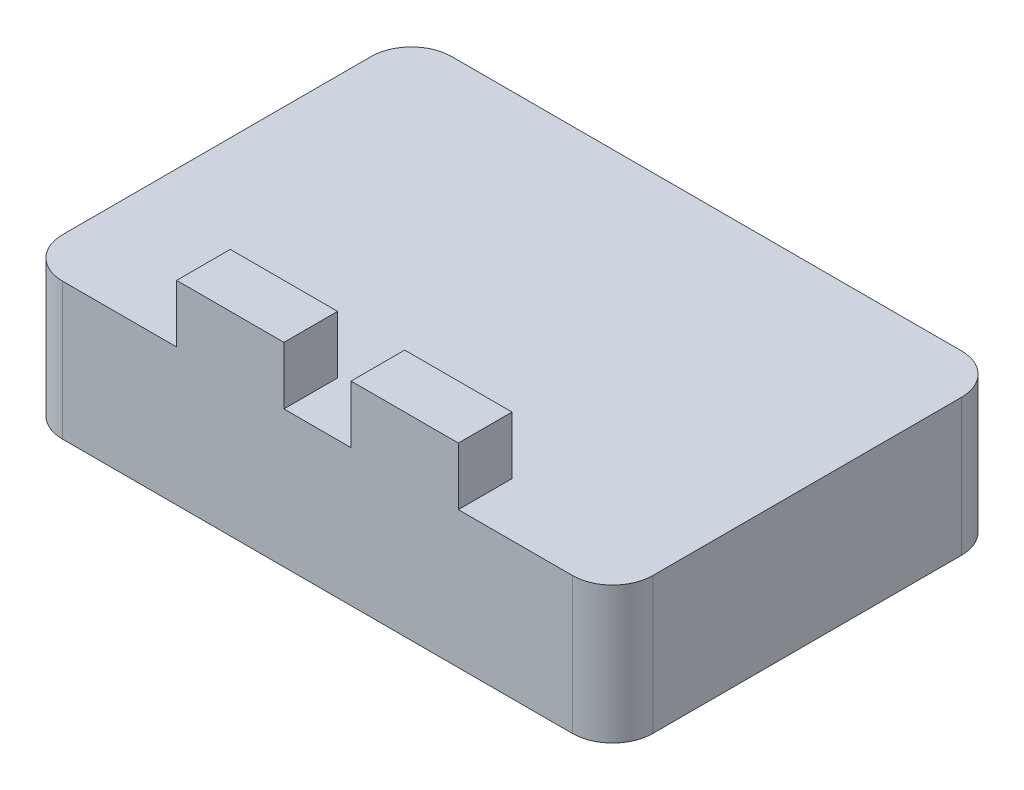
ISO-10303-21;
HEADER;
FILE_DESCRIPTION(('STEP AP214'),'2;1');
FILE_NAME('part.step','',(''),(''),'','','');
FILE_SCHEMA(('AUTOMOTIVE_DESIGN { 1 0 10303 214 1 1 1 1 }'));
ENDSEC;
DATA;
#1=APPLICATION_CONTEXT('core data for automotive mechanical design processes');
#2=APPLICATION_PROTOCOL_DEFINITION('international standard','automotive_design',2000,#1);
#3=PRODUCT_CONTEXT('',#1,'mechanical');
#4=PRODUCT('Part','Part','',(#3));
#5=PRODUCT_RELATED_PRODUCT_CATEGORY('part','',(#4));
#6=PRODUCT_DEFINITION_FORMATION('','',#4);
#7=PRODUCT_DEFINITION_CONTEXT('part definition',#1,'design');
#8=PRODUCT_DEFINITION('design','',#6,#7);
#9=PRODUCT_DEFINITION_SHAPE('','',#8);
#10=(LENGTH_UNIT() NAMED_UNIT(*) SI_UNIT(.MILLI.,.METRE.));
#11=(NAMED_UNIT(*) PLANE_ANGLE_UNIT() SI_UNIT($,.RADIAN.));
#12=(NAMED_UNIT(*) SI_UNIT($,.STERADIAN.) SOLID_ANGLE_UNIT());
#13=UNCERTAINTY_MEASURE_WITH_UNIT(LENGTH_MEASURE(1.E-05),#10,'distance_accuracy_value','');
#14=(GEOMETRIC_REPRESENTATION_CONTEXT(3) GLOBAL_UNCERTAINTY_ASSIGNED_CONTEXT((#13)) GLOBAL_UNIT_ASSIGNED_CONTEXT((#10,
#11,#12)) REPRESENTATION_CONTEXT('',''));
#15=CARTESIAN_POINT('',(0.,0.,0.));
#16=DIRECTION('',(0.,0.,1.));
#17=DIRECTION('',(1.,0.,0.));
#18=AXIS2_PLACEMENT_3D('',#15,#16,#17);
#19=CARTESIAN_POINT('',(0.,10.2,0.));
#20=DIRECTION('',(0.,-1.,0.));
#21=DIRECTION('',(0.,0.,-1.));
#22=AXIS2_PLACEMENT_3D('',#19,#20,#21);
#23=PLANE('',#22);
#24=DIRECTION('',(0.,0.,-1.));
#25=VECTOR('',#24,1.);
#26=CARTESIAN_POINT('',(44.,10.2,0.));
#27=LINE('',#26,#25);
#28=CARTESIAN_POINT('',(44.,10.2,-3.));
#29=VERTEX_POINT('',#28);
#30=CARTESIAN_POINT('',(44.,10.2,-26.));
#31=VERTEX_POINT('',#30);
#32=EDGE_CURVE('E262',#29,#31,#27,.T.);
#33=ORIENTED_EDGE('',*,*,#32,.T.);
#34=CARTESIAN_POINT('',(41.,10.2,-26.));
#35=DIRECTION('',(0.,-1.,0.));
#36=DIRECTION('',(0.,0.,-1.));
#37=AXIS2_PLACEMENT_3D('',#34,#35,#36);
#38=CIRCLE('',#37,3.);
#39=CARTESIAN_POINT('',(41.,10.2,-29.));
#40=VERTEX_POINT('',#39);
#41=EDGE_CURVE('E315',#31,#40,#38,.F.);
#42=ORIENTED_EDGE('',*,*,#41,.T.);
#43=DIRECTION('',(-1.,0.,0.));
#44=VECTOR('',#43,1.);
#45=CARTESIAN_POINT('',(0.,10.2,-29.));
#46=LINE('',#45,#44);
#47=CARTESIAN_POINT('',(3.,10.2,-29.));
#48=VERTEX_POINT('',#47);
#49=EDGE_CURVE('E265',#40,#48,#46,.T.);
#50=ORIENTED_EDGE('',*,*,#49,.T.);
#51=CARTESIAN_POINT('',(3.,10.2,-26.));
#52=DIRECTION('',(0.,-1.,0.));
#53=DIRECTION('',(0.,0.,-1.));
#54=AXIS2_PLACEMENT_3D('',#51,#52,#53);
#55=CIRCLE('',#54,3.);
#56=CARTESIAN_POINT('',(0.,10.2,-26.));
#57=VERTEX_POINT('',#56);
#58=EDGE_CURVE('E312',#48,#57,#55,.F.);
#59=ORIENTED_EDGE('',*,*,#58,.T.);
#60=DIRECTION('',(0.,0.,1.));
#61=VECTOR('',#60,1.);
#62=CARTESIAN_POINT('',(0.,10.2,0.));
#63=LINE('',#62,#61);
#64=CARTESIAN_POINT('',(0.,10.2,-3.));
#65=VERTEX_POINT('',#64);
#66=EDGE_CURVE('E169',#57,#65,#63,.T.);
#67=ORIENTED_EDGE('',*,*,#66,.T.);
#68=CARTESIAN_POINT('',(3.,10.2,-3.));
#69=DIRECTION('',(0.,-1.,0.));
#70=DIRECTION('',(0.,0.,-1.));
#71=AXIS2_PLACEMENT_3D('',#68,#69,#70);
#72=CIRCLE('',#71,3.);
#73=CARTESIAN_POINT('',(3.,10.2,0.));
#74=VERTEX_POINT('',#73);
#75=EDGE_CURVE('E58',#65,#74,#72,.F.);
#76=ORIENTED_EDGE('',*,*,#75,.T.);
#77=DIRECTION('',(1.,0.,0.));
#78=VECTOR('',#77,1.);
#79=CARTESIAN_POINT('',(0.,10.2,0.));
#80=LINE('',#79,#78);
#81=CARTESIAN_POINT('',(11.5,10.2,0.));
#82=VERTEX_POINT('',#81);
#83=EDGE_CURVE('E171',#74,#82,#80,.T.);
#84=ORIENTED_EDGE('',*,*,#83,.T.);
#85=DIRECTION('',(0.,0.,1.));
#86=VECTOR('',#85,1.);
#87=CARTESIAN_POINT('',(11.5,10.2,0.));
#88=LINE('',#87,#86);
#89=CARTESIAN_POINT('',(11.5,10.2,-4.));
#90=VERTEX_POINT('',#89);
#91=EDGE_CURVE('E206',#90,#82,#88,.T.);
#92=ORIENTED_EDGE('',*,*,#91,.F.);
#93=DIRECTION('',(-1.,0.,0.));
#94=VECTOR('',#93,1.);
#95=CARTESIAN_POINT('',(19.5,10.2,-4.));
#96=LINE('',#95,#94);
#97=CARTESIAN_POINT('',(19.5,10.2,-4.));
#98=VERTEX_POINT('',#97);
#99=EDGE_CURVE('E222',#98,#90,#96,.T.);
#100=ORIENTED_EDGE('',*,*,#99,.F.);
#101=DIRECTION('',(0.,0.,-1.));
#102=VECTOR('',#101,1.);
#103=CARTESIAN_POINT('',(19.5,10.2,0.));
#104=LINE('',#103,#102);
#105=CARTESIAN_POINT('',(19.5,10.2,0.));
#106=VERTEX_POINT('',#105);
#107=EDGE_CURVE('E235',#106,#98,#104,.T.);
#108=ORIENTED_EDGE('',*,*,#107,.F.);
#109=CARTESIAN_POINT('',(24.5,10.2,0.));
#110=VERTEX_POINT('',#109);
#111=EDGE_CURVE('E168',#106,#110,#80,.T.);
#112=ORIENTED_EDGE('',*,*,#111,.T.);
#113=DIRECTION('',(0.,0.,1.));
#114=VECTOR('',#113,1.);
#115=CARTESIAN_POINT('',(24.5,10.2,0.));
#116=LINE('',#115,#114);
#117=CARTESIAN_POINT('',(24.5,10.2,-4.));
#118=VERTEX_POINT('',#117);
#119=EDGE_CURVE('E181',#118,#110,#116,.T.);
#120=ORIENTED_EDGE('',*,*,#119,.F.);
#121=DIRECTION('',(-1.,0.,0.));
#122=VECTOR('',#121,1.);
#123=CARTESIAN_POINT('',(24.5,10.2,-4.));
#124=LINE('',#123,#122);
#125=CARTESIAN_POINT('',(32.5,10.2,-4.));
#126=VERTEX_POINT('',#125);
#127=EDGE_CURVE('E176',#126,#118,#124,.T.);
#128=ORIENTED_EDGE('',*,*,#127,.F.);
#129=DIRECTION('',(0.,0.,-1.));
#130=VECTOR('',#129,1.);
#131=CARTESIAN_POINT('',(32.5,10.2,0.));
#132=LINE('',#131,#130);
#133=CARTESIAN_POINT('',(32.5,10.2,0.));
#134=VERTEX_POINT('',#133);
#135=EDGE_CURVE('E173',#134,#126,#132,.T.);
#136=ORIENTED_EDGE('',*,*,#135,.F.);
#137=CARTESIAN_POINT('',(41.,10.2,0.));
#138=VERTEX_POINT('',#137);
#139=EDGE_CURVE('E158',#134,#138,#80,.T.);
#140=ORIENTED_EDGE('',*,*,#139,.T.);
#141=CARTESIAN_POINT('',(41.,10.2,-3.));
#142=DIRECTION('',(0.,-1.,0.));
#143=DIRECTION('',(0.,0.,-1.));
#144=AXIS2_PLACEMENT_3D('',#141,#142,#143);
#145=CIRCLE('',#144,3.);
#146=EDGE_CURVE('E307',#138,#29,#145,.F.);
#147=ORIENTED_EDGE('',*,*,#146,.T.);
#148=EDGE_LOOP('',(#33,#42,#50,#59,#67,#76,#84,#92,#100,#108,#112,#120,#128,#136,#140,#147));
#149=FACE_BOUND('',#148,.T.);
#150=ADVANCED_FACE('F42',(#149),#23,.F.);
#151=CARTESIAN_POINT('',(0.,10.2,0.));
#152=DIRECTION('',(1.,0.,0.));
#153=DIRECTION('',(0.,0.,-1.));
#154=AXIS2_PLACEMENT_3D('',#151,#152,#153);
#155=PLANE('',#154);
#156=ORIENTED_EDGE('',*,*,#66,.F.);
#157=DIRECTION('',(0.,-1.,0.));
#158=VECTOR('',#157,1.);
#159=CARTESIAN_POINT('',(0.,10.2,-26.));
#160=LINE('',#159,#158);
#161=CARTESIAN_POINT('',(0.,0.,-26.));
#162=VERTEX_POINT('',#161);
#163=EDGE_CURVE('E320',#57,#162,#160,.T.);
#164=ORIENTED_EDGE('',*,*,#163,.T.);
#165=DIRECTION('',(0.,0.,1.));
#166=VECTOR('',#165,1.);
#167=CARTESIAN_POINT('',(0.,0.,0.));
#168=LINE('',#167,#166);
#169=CARTESIAN_POINT('',(0.,0.,-3.));
#170=VERTEX_POINT('',#169);
#171=EDGE_CURVE('E257',#162,#170,#168,.T.);
#172=ORIENTED_EDGE('',*,*,#171,.T.);
#173=DIRECTION('',(0.,-1.,0.));
#174=VECTOR('',#173,1.);
#175=CARTESIAN_POINT('',(0.,10.2,-3.));
#176=LINE('',#175,#174);
#177=EDGE_CURVE('E66',#170,#65,#176,.F.);
#178=ORIENTED_EDGE('',*,*,#177,.T.);
#179=EDGE_LOOP('',(#156,#164,#172,#178));
#180=FACE_BOUND('',#179,.T.);
#181=ADVANCED_FACE('F350',(#180),#155,.F.);
#182=CARTESIAN_POINT('',(0.,10.2,0.));
#183=DIRECTION('',(0.,0.,-1.));
#184=DIRECTION('',(-1.,0.,0.));
#185=AXIS2_PLACEMENT_3D('',#182,#183,#184);
#186=PLANE('',#185);
#187=ORIENTED_EDGE('',*,*,#83,.F.);
#188=DIRECTION('',(0.,-1.,0.));
#189=VECTOR('',#188,1.);
#190=CARTESIAN_POINT('',(3.,10.2,0.));
#191=LINE('',#190,#189);
#192=CARTESIAN_POINT('',(3.,0.,0.));
#193=VERTEX_POINT('',#192);
#194=EDGE_CURVE('E11',#74,#193,#191,.T.);
#195=ORIENTED_EDGE('',*,*,#194,.T.);
#196=DIRECTION('',(1.,0.,0.));
#197=VECTOR('',#196,1.);
#198=CARTESIAN_POINT('',(0.,0.,0.));
#199=LINE('',#198,#197);
#200=CARTESIAN_POINT('',(41.,0.,0.));
#201=VERTEX_POINT('',#200);
#202=EDGE_CURVE('E272',#193,#201,#199,.T.);
#203=ORIENTED_EDGE('',*,*,#202,.T.);
#204=DIRECTION('',(0.,-1.,0.));
#205=VECTOR('',#204,1.);
#206=CARTESIAN_POINT('',(41.,10.2,0.));
#207=LINE('',#206,#205);
#208=EDGE_CURVE('E51',#201,#138,#207,.F.);
#209=ORIENTED_EDGE('',*,*,#208,.T.);
#210=ORIENTED_EDGE('',*,*,#139,.F.);
#211=DIRECTION('',(0.,-1.,0.));
#212=VECTOR('',#211,1.);
#213=CARTESIAN_POINT('',(32.5,14.5,0.));
#214=LINE('',#213,#212);
#215=CARTESIAN_POINT('',(32.5,14.5,0.));
#216=VERTEX_POINT('',#215);
#217=EDGE_CURVE('E162',#216,#134,#214,.T.);
#218=ORIENTED_EDGE('',*,*,#217,.F.);
#219=DIRECTION('',(1.,0.,0.));
#220=VECTOR('',#219,1.);
#221=CARTESIAN_POINT('',(24.5,14.5,0.));
#222=LINE('',#221,#220);
#223=CARTESIAN_POINT('',(24.5,14.5,0.));
#224=VERTEX_POINT('',#223);
#225=EDGE_CURVE('E211',#224,#216,#222,.T.);
#226=ORIENTED_EDGE('',*,*,#225,.F.);
#227=DIRECTION('',(0.,-1.,0.));
#228=VECTOR('',#227,1.);
#229=CARTESIAN_POINT('',(24.5,14.5,0.));
#230=LINE('',#229,#228);
#231=EDGE_CURVE('E187',#224,#110,#230,.T.);
#232=ORIENTED_EDGE('',*,*,#231,.T.);
#233=ORIENTED_EDGE('',*,*,#111,.F.);
#234=DIRECTION('',(0.,-1.,0.));
#235=VECTOR('',#234,1.);
#236=CARTESIAN_POINT('',(19.5,14.5,0.));
#237=LINE('',#236,#235);
#238=CARTESIAN_POINT('',(19.5,14.5,0.));
#239=VERTEX_POINT('',#238);
#240=EDGE_CURVE('E249',#239,#106,#237,.T.);
#241=ORIENTED_EDGE('',*,*,#240,.F.);
#242=DIRECTION('',(1.,0.,0.));
#243=VECTOR('',#242,1.);
#244=CARTESIAN_POINT('',(19.5,14.5,0.));
#245=LINE('',#244,#243);
#246=CARTESIAN_POINT('',(11.5,14.5,0.));
#247=VERTEX_POINT('',#246);
#248=EDGE_CURVE('E221',#247,#239,#245,.T.);
#249=ORIENTED_EDGE('',*,*,#248,.F.);
#250=DIRECTION('',(0.,-1.,0.));
#251=VECTOR('',#250,1.);
#252=CARTESIAN_POINT('',(11.5,14.5,0.));
#253=LINE('',#252,#251);
#254=EDGE_CURVE('E253',#247,#82,#253,.T.);
#255=ORIENTED_EDGE('',*,*,#254,.T.);
#256=EDGE_LOOP('',(#187,#195,#203,#209,#210,#218,#226,#232,#233,#241,#249,#255));
#257=FACE_BOUND('',#256,.T.);
#258=ADVANCED_FACE('F160',(#257),#186,.F.);
#259=CARTESIAN_POINT('',(44.,10.2,0.));
#260=DIRECTION('',(-1.,0.,0.));
#261=DIRECTION('',(0.,0.,1.));
#262=AXIS2_PLACEMENT_3D('',#259,#260,#261);
#263=PLANE('',#262);
#264=DIRECTION('',(0.,0.,-1.));
#265=VECTOR('',#264,1.);
#266=CARTESIAN_POINT('',(44.,0.,0.));
#267=LINE('',#266,#265);
#268=CARTESIAN_POINT('',(44.,0.,-3.));
#269=VERTEX_POINT('',#268);
#270=CARTESIAN_POINT('',(44.,0.,-26.));
#271=VERTEX_POINT('',#270);
#272=EDGE_CURVE('E275',#269,#271,#267,.T.);
#273=ORIENTED_EDGE('',*,*,#272,.T.);
#274=DIRECTION('',(0.,-1.,0.));
#275=VECTOR('',#274,1.);
#276=CARTESIAN_POINT('',(44.,10.2,-26.));
#277=LINE('',#276,#275);
#278=EDGE_CURVE('E304',#271,#31,#277,.F.);
#279=ORIENTED_EDGE('',*,*,#278,.T.);
#280=ORIENTED_EDGE('',*,*,#32,.F.);
#281=DIRECTION('',(0.,-1.,0.));
#282=VECTOR('',#281,1.);
#283=CARTESIAN_POINT('',(44.,10.2,-3.));
#284=LINE('',#283,#282);
#285=EDGE_CURVE('E300',#29,#269,#284,.T.);
#286=ORIENTED_EDGE('',*,*,#285,.T.);
#287=EDGE_LOOP('',(#273,#279,#280,#286));
#288=FACE_BOUND('',#287,.T.);
#289=ADVANCED_FACE('F367',(#288),#263,.F.);
#290=CARTESIAN_POINT('',(0.,10.2,-29.));
#291=DIRECTION('',(0.,0.,1.));
#292=DIRECTION('',(1.,0.,0.));
#293=AXIS2_PLACEMENT_3D('',#290,#291,#292);
#294=PLANE('',#293);
#295=ORIENTED_EDGE('',*,*,#49,.F.);
#296=DIRECTION('',(0.,-1.,0.));
#297=VECTOR('',#296,1.);
#298=CARTESIAN_POINT('',(41.,10.2,-29.));
#299=LINE('',#298,#297);
#300=CARTESIAN_POINT('',(41.,0.,-29.));
#301=VERTEX_POINT('',#300);
#302=EDGE_CURVE('E284',#40,#301,#299,.T.);
#303=ORIENTED_EDGE('',*,*,#302,.T.);
#304=DIRECTION('',(-1.,0.,0.));
#305=VECTOR('',#304,1.);
#306=CARTESIAN_POINT('',(0.,0.,-29.));
#307=LINE('',#306,#305);
#308=CARTESIAN_POINT('',(3.,0.,-29.));
#309=VERTEX_POINT('',#308);
#310=EDGE_CURVE('E259',#301,#309,#307,.T.);
#311=ORIENTED_EDGE('',*,*,#310,.T.);
#312=DIRECTION('',(0.,-1.,0.));
#313=VECTOR('',#312,1.);
#314=CARTESIAN_POINT('',(3.,10.2,-29.));
#315=LINE('',#314,#313);
#316=EDGE_CURVE('E269',#309,#48,#315,.F.);
#317=ORIENTED_EDGE('',*,*,#316,.T.);
#318=EDGE_LOOP('',(#295,#303,#311,#317));
#319=FACE_BOUND('',#318,.T.);
#320=ADVANCED_FACE('F363',(#319),#294,.F.);
#321=CARTESIAN_POINT('',(0.,0.,0.));
#322=DIRECTION('',(0.,-1.,0.));
#323=DIRECTION('',(0.,0.,-1.));
#324=AXIS2_PLACEMENT_3D('',#321,#322,#323);
#325=PLANE('',#324);
#326=ORIENTED_EDGE('',*,*,#310,.F.);
#327=CARTESIAN_POINT('',(41.,0.,-26.));
#328=DIRECTION('',(0.,-1.,0.));
#329=DIRECTION('',(0.,0.,-1.));
#330=AXIS2_PLACEMENT_3D('',#327,#328,#329);
#331=CIRCLE('',#330,3.);
#332=EDGE_CURVE('E297',#301,#271,#331,.T.);
#333=ORIENTED_EDGE('',*,*,#332,.T.);
#334=ORIENTED_EDGE('',*,*,#272,.F.);
#335=CARTESIAN_POINT('',(41.,0.,-3.));
#336=DIRECTION('',(0.,-1.,0.));
#337=DIRECTION('',(0.,0.,-1.));
#338=AXIS2_PLACEMENT_3D('',#335,#336,#337);
#339=CIRCLE('',#338,3.);
#340=EDGE_CURVE('E288',#269,#201,#339,.T.);
#341=ORIENTED_EDGE('',*,*,#340,.T.);
#342=ORIENTED_EDGE('',*,*,#202,.F.);
#343=CARTESIAN_POINT('',(3.,0.,-3.));
#344=DIRECTION('',(0.,-1.,0.));
#345=DIRECTION('',(0.,0.,-1.));
#346=AXIS2_PLACEMENT_3D('',#343,#344,#345);
#347=CIRCLE('',#346,3.);
#348=EDGE_CURVE('E291',#193,#170,#347,.T.);
#349=ORIENTED_EDGE('',*,*,#348,.T.);
#350=ORIENTED_EDGE('',*,*,#171,.F.);
#351=CARTESIAN_POINT('',(3.,0.,-26.));
#352=DIRECTION('',(0.,-1.,0.));
#353=DIRECTION('',(0.,0.,-1.));
#354=AXIS2_PLACEMENT_3D('',#351,#352,#353);
#355=CIRCLE('',#354,3.);
#356=EDGE_CURVE('E294',#162,#309,#355,.T.);
#357=ORIENTED_EDGE('',*,*,#356,.T.);
#358=EDGE_LOOP('',(#326,#333,#334,#341,#342,#349,#350,#357));
#359=FACE_BOUND('',#358,.T.);
#360=ADVANCED_FACE('F360',(#359),#325,.T.);
#361=CARTESIAN_POINT('',(11.5,14.5,0.));
#362=DIRECTION('',(1.,0.,0.));
#363=DIRECTION('',(0.,0.,-1.));
#364=AXIS2_PLACEMENT_3D('',#361,#362,#363);
#365=PLANE('',#364);
#366=ORIENTED_EDGE('',*,*,#91,.T.);
#367=ORIENTED_EDGE('',*,*,#254,.F.);
#368=DIRECTION('',(0.,0.,1.));
#369=VECTOR('',#368,1.);
#370=CARTESIAN_POINT('',(11.5,14.5,0.));
#371=LINE('',#370,#369);
#372=CARTESIAN_POINT('',(11.5,14.5,-4.));
#373=VERTEX_POINT('',#372);
#374=EDGE_CURVE('E217',#373,#247,#371,.T.);
#375=ORIENTED_EDGE('',*,*,#374,.F.);
#376=DIRECTION('',(0.,-1.,0.));
#377=VECTOR('',#376,1.);
#378=CARTESIAN_POINT('',(11.5,14.5,-4.));
#379=LINE('',#378,#377);
#380=EDGE_CURVE('E231',#373,#90,#379,.T.);
#381=ORIENTED_EDGE('',*,*,#380,.T.);
#382=EDGE_LOOP('',(#366,#367,#375,#381));
#383=FACE_BOUND('',#382,.T.);
#384=ADVANCED_FACE('F358',(#383),#365,.F.);
#385=CARTESIAN_POINT('',(19.5,14.5,0.));
#386=DIRECTION('',(-1.,0.,0.));
#387=DIRECTION('',(0.,0.,1.));
#388=AXIS2_PLACEMENT_3D('',#385,#386,#387);
#389=PLANE('',#388);
#390=ORIENTED_EDGE('',*,*,#107,.T.);
#391=DIRECTION('',(0.,-1.,0.));
#392=VECTOR('',#391,1.);
#393=CARTESIAN_POINT('',(19.5,14.5,-4.));
#394=LINE('',#393,#392);
#395=CARTESIAN_POINT('',(19.5,14.5,-4.));
#396=VERTEX_POINT('',#395);
#397=EDGE_CURVE('E245',#396,#98,#394,.T.);
#398=ORIENTED_EDGE('',*,*,#397,.F.);
#399=DIRECTION('',(0.,0.,-1.));
#400=VECTOR('',#399,1.);
#401=CARTESIAN_POINT('',(19.5,14.5,0.));
#402=LINE('',#401,#400);
#403=EDGE_CURVE('E225',#239,#396,#402,.T.);
#404=ORIENTED_EDGE('',*,*,#403,.F.);
#405=ORIENTED_EDGE('',*,*,#240,.T.);
#406=EDGE_LOOP('',(#390,#398,#404,#405));
#407=FACE_BOUND('',#406,.T.);
#408=ADVANCED_FACE('F409',(#407),#389,.F.);
#409=CARTESIAN_POINT('',(19.5,14.5,-4.));
#410=DIRECTION('',(0.,0.,1.));
#411=DIRECTION('',(1.,0.,0.));
#412=AXIS2_PLACEMENT_3D('',#409,#410,#411);
#413=PLANE('',#412);
#414=ORIENTED_EDGE('',*,*,#99,.T.);
#415=ORIENTED_EDGE('',*,*,#380,.F.);
#416=DIRECTION('',(-1.,0.,0.));
#417=VECTOR('',#416,1.);
#418=CARTESIAN_POINT('',(19.5,14.5,-4.));
#419=LINE('',#418,#417);
#420=EDGE_CURVE('E228',#396,#373,#419,.T.);
#421=ORIENTED_EDGE('',*,*,#420,.F.);
#422=ORIENTED_EDGE('',*,*,#397,.T.);
#423=EDGE_LOOP('',(#414,#415,#421,#422));
#424=FACE_BOUND('',#423,.T.);
#425=ADVANCED_FACE('F401',(#424),#413,.F.);
#426=CARTESIAN_POINT('',(0.,14.5,0.));
#427=DIRECTION('',(0.,1.,0.));
#428=DIRECTION('',(0.,0.,1.));
#429=AXIS2_PLACEMENT_3D('',#426,#427,#428);
#430=PLANE('',#429);
#431=ORIENTED_EDGE('',*,*,#374,.T.);
#432=ORIENTED_EDGE('',*,*,#248,.T.);
#433=ORIENTED_EDGE('',*,*,#403,.T.);
#434=ORIENTED_EDGE('',*,*,#420,.T.);
#435=EDGE_LOOP('',(#431,#432,#433,#434));
#436=FACE_BOUND('',#435,.T.);
#437=ADVANCED_FACE('F406',(#436),#430,.T.);
#438=CARTESIAN_POINT('',(24.5,14.5,0.));
#439=DIRECTION('',(1.,0.,0.));
#440=DIRECTION('',(0.,0.,-1.));
#441=AXIS2_PLACEMENT_3D('',#438,#439,#440);
#442=PLANE('',#441);
#443=ORIENTED_EDGE('',*,*,#119,.T.);
#444=ORIENTED_EDGE('',*,*,#231,.F.);
#445=DIRECTION('',(0.,0.,1.));
#446=VECTOR('',#445,1.);
#447=CARTESIAN_POINT('',(24.5,14.5,0.));
#448=LINE('',#447,#446);
#449=CARTESIAN_POINT('',(24.5,14.5,-4.));
#450=VERTEX_POINT('',#449);
#451=EDGE_CURVE('E201',#450,#224,#448,.T.);
#452=ORIENTED_EDGE('',*,*,#451,.F.);
#453=DIRECTION('',(0.,-1.,0.));
#454=VECTOR('',#453,1.);
#455=CARTESIAN_POINT('',(24.5,14.5,-4.));
#456=LINE('',#455,#454);
#457=EDGE_CURVE('E191',#450,#118,#456,.T.);
#458=ORIENTED_EDGE('',*,*,#457,.T.);
#459=EDGE_LOOP('',(#443,#444,#452,#458));
#460=FACE_BOUND('',#459,.T.);
#461=ADVANCED_FACE('F330',(#460),#442,.F.);
#462=CARTESIAN_POINT('',(32.5,14.5,0.));
#463=DIRECTION('',(-1.,0.,0.));
#464=DIRECTION('',(0.,0.,1.));
#465=AXIS2_PLACEMENT_3D('',#462,#463,#464);
#466=PLANE('',#465);
#467=ORIENTED_EDGE('',*,*,#135,.T.);
#468=DIRECTION('',(0.,-1.,0.));
#469=VECTOR('',#468,1.);
#470=CARTESIAN_POINT('',(32.5,14.5,-4.));
#471=LINE('',#470,#469);
#472=CARTESIAN_POINT('',(32.5,14.5,-4.));
#473=VERTEX_POINT('',#472);
#474=EDGE_CURVE('E186',#473,#126,#471,.T.);
#475=ORIENTED_EDGE('',*,*,#474,.F.);
#476=DIRECTION('',(0.,0.,-1.));
#477=VECTOR('',#476,1.);
#478=CARTESIAN_POINT('',(32.5,14.5,0.));
#479=LINE('',#478,#477);
#480=EDGE_CURVE('E184',#216,#473,#479,.T.);
#481=ORIENTED_EDGE('',*,*,#480,.F.);
#482=ORIENTED_EDGE('',*,*,#217,.T.);
#483=EDGE_LOOP('',(#467,#475,#481,#482));
#484=FACE_BOUND('',#483,.T.);
#485=ADVANCED_FACE('F183',(#484),#466,.F.);
#486=CARTESIAN_POINT('',(24.5,14.5,-4.));
#487=DIRECTION('',(0.,0.,1.));
#488=DIRECTION('',(1.,0.,0.));
#489=AXIS2_PLACEMENT_3D('',#486,#487,#488);
#490=PLANE('',#489);
#491=ORIENTED_EDGE('',*,*,#127,.T.);
#492=ORIENTED_EDGE('',*,*,#457,.F.);
#493=DIRECTION('',(-1.,0.,0.));
#494=VECTOR('',#493,1.);
#495=CARTESIAN_POINT('',(24.5,14.5,-4.));
#496=LINE('',#495,#494);
#497=EDGE_CURVE('E199',#473,#450,#496,.T.);
#498=ORIENTED_EDGE('',*,*,#497,.F.);
#499=ORIENTED_EDGE('',*,*,#474,.T.);
#500=EDGE_LOOP('',(#491,#492,#498,#499));
#501=FACE_BOUND('',#500,.T.);
#502=ADVANCED_FACE('F334',(#501),#490,.F.);
#503=CARTESIAN_POINT('',(0.,14.5,0.));
#504=DIRECTION('',(0.,-1.,0.));
#505=DIRECTION('',(0.,0.,-1.));
#506=AXIS2_PLACEMENT_3D('',#503,#504,#505);
#507=PLANE('',#506);
#508=ORIENTED_EDGE('',*,*,#451,.T.);
#509=ORIENTED_EDGE('',*,*,#225,.T.);
#510=ORIENTED_EDGE('',*,*,#480,.T.);
#511=ORIENTED_EDGE('',*,*,#497,.T.);
#512=EDGE_LOOP('',(#508,#509,#510,#511));
#513=FACE_BOUND('',#512,.T.);
#514=ADVANCED_FACE('F336',(#513),#507,.F.);
#515=CARTESIAN_POINT('',(41.,10.2,-26.));
#516=DIRECTION('',(0.,-1.,0.));
#517=DIRECTION('',(0.,0.,-1.));
#518=AXIS2_PLACEMENT_3D('',#515,#516,#517);
#519=CYLINDRICAL_SURFACE('',#518,3.);
#520=ORIENTED_EDGE('',*,*,#41,.F.);
#521=ORIENTED_EDGE('',*,*,#278,.F.);
#522=ORIENTED_EDGE('',*,*,#332,.F.);
#523=ORIENTED_EDGE('',*,*,#302,.F.);
#524=EDGE_LOOP('',(#520,#521,#522,#523));
#525=FACE_BOUND('',#524,.T.);
#526=ADVANCED_FACE('F338',(#525),#519,.T.);
#527=CARTESIAN_POINT('',(3.,10.2,-26.));
#528=DIRECTION('',(0.,-1.,0.));
#529=DIRECTION('',(0.,0.,-1.));
#530=AXIS2_PLACEMENT_3D('',#527,#528,#529);
#531=CYLINDRICAL_SURFACE('',#530,3.);
#532=ORIENTED_EDGE('',*,*,#58,.F.);
#533=ORIENTED_EDGE('',*,*,#316,.F.);
#534=ORIENTED_EDGE('',*,*,#356,.F.);
#535=ORIENTED_EDGE('',*,*,#163,.F.);
#536=EDGE_LOOP('',(#532,#533,#534,#535));
#537=FACE_BOUND('',#536,.T.);
#538=ADVANCED_FACE('F344',(#537),#531,.T.);
#539=CARTESIAN_POINT('',(3.,10.2,-3.));
#540=DIRECTION('',(0.,-1.,0.));
#541=DIRECTION('',(0.,0.,-1.));
#542=AXIS2_PLACEMENT_3D('',#539,#540,#541);
#543=CYLINDRICAL_SURFACE('',#542,3.);
#544=ORIENTED_EDGE('',*,*,#75,.F.);
#545=ORIENTED_EDGE('',*,*,#177,.F.);
#546=ORIENTED_EDGE('',*,*,#348,.F.);
#547=ORIENTED_EDGE('',*,*,#194,.F.);
#548=EDGE_LOOP('',(#544,#545,#546,#547));
#549=FACE_BOUND('',#548,.T.);
#550=ADVANCED_FACE('F375',(#549),#543,.T.);
#551=CARTESIAN_POINT('',(41.,10.2,-3.));
#552=DIRECTION('',(0.,-1.,0.));
#553=DIRECTION('',(0.,0.,-1.));
#554=AXIS2_PLACEMENT_3D('',#551,#552,#553);
#555=CYLINDRICAL_SURFACE('',#554,3.);
#556=ORIENTED_EDGE('',*,*,#146,.F.);
#557=ORIENTED_EDGE('',*,*,#208,.F.);
#558=ORIENTED_EDGE('',*,*,#340,.F.);
#559=ORIENTED_EDGE('',*,*,#285,.F.);
#560=EDGE_LOOP('',(#556,#557,#558,#559));
#561=FACE_BOUND('',#560,.T.);
#562=ADVANCED_FACE('F44',(#561),#555,.T.);
#563=CLOSED_SHELL('',(#150,#181,#258,#289,#320,#360,#384,#408,#425,#437,#461,#485,#502,#514,
#526,#538,#550,#562));
#564=MANIFOLD_SOLID_BREP('B2',#563);
#565=ADVANCED_BREP_SHAPE_REPRESENTATION('',(#18,#564),#14);
#566=SHAPE_DEFINITION_REPRESENTATION(#9,#565);
ENDSEC;
END-ISO-10303-21;
